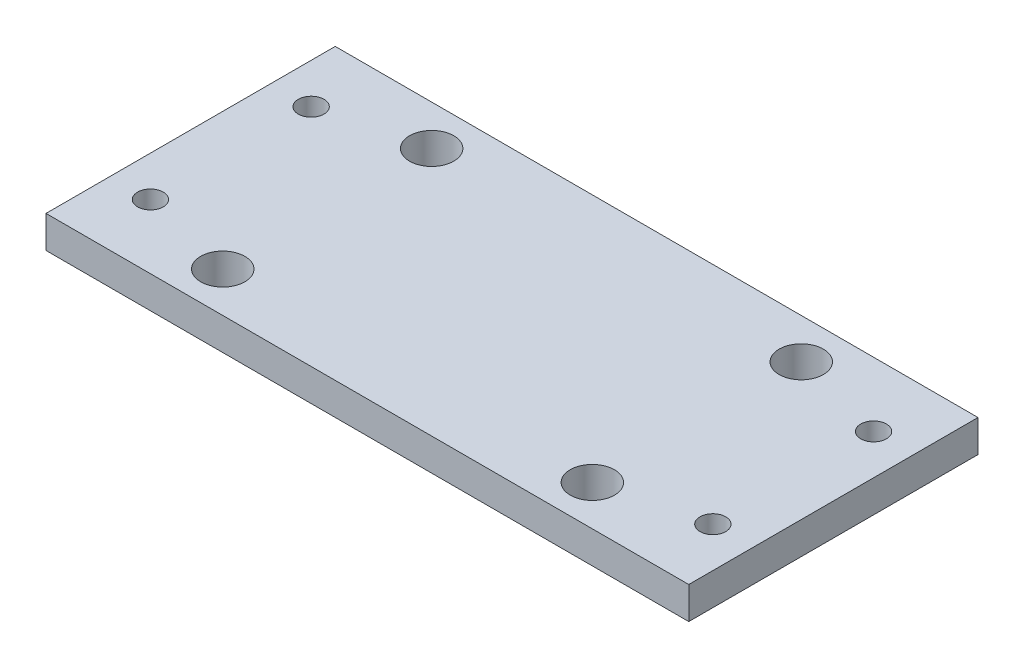
ISO-10303-21;
HEADER;
FILE_DESCRIPTION(('STEP AP214'),'2;1');
FILE_NAME('part.step','',(''),(''),'','','');
FILE_SCHEMA(('AUTOMOTIVE_DESIGN { 1 0 10303 214 1 1 1 1 }'));
ENDSEC;
DATA;
#1=APPLICATION_CONTEXT('core data for automotive mechanical design processes');
#2=APPLICATION_PROTOCOL_DEFINITION('international standard','automotive_design',2000,#1);
#3=PRODUCT_CONTEXT('',#1,'mechanical');
#4=PRODUCT('Part','Part','',(#3));
#5=PRODUCT_RELATED_PRODUCT_CATEGORY('part','',(#4));
#6=PRODUCT_DEFINITION_FORMATION('','',#4);
#7=PRODUCT_DEFINITION_CONTEXT('part definition',#1,'design');
#8=PRODUCT_DEFINITION('design','',#6,#7);
#9=PRODUCT_DEFINITION_SHAPE('','',#8);
#10=(LENGTH_UNIT() NAMED_UNIT(*) SI_UNIT(.MILLI.,.METRE.));
#11=(NAMED_UNIT(*) PLANE_ANGLE_UNIT() SI_UNIT($,.RADIAN.));
#12=(NAMED_UNIT(*) SI_UNIT($,.STERADIAN.) SOLID_ANGLE_UNIT());
#13=UNCERTAINTY_MEASURE_WITH_UNIT(LENGTH_MEASURE(1.E-05),#10,'distance_accuracy_value','');
#14=(GEOMETRIC_REPRESENTATION_CONTEXT(3) GLOBAL_UNCERTAINTY_ASSIGNED_CONTEXT((#13)) GLOBAL_UNIT_ASSIGNED_CONTEXT((#10,
#11,#12)) REPRESENTATION_CONTEXT('',''));
#15=CARTESIAN_POINT('',(0.,0.,0.));
#16=DIRECTION('',(0.,0.,1.));
#17=DIRECTION('',(1.,0.,0.));
#18=AXIS2_PLACEMENT_3D('',#15,#16,#17);
#19=CARTESIAN_POINT('',(0.,4.,0.));
#20=DIRECTION('',(0.,1.,0.));
#21=DIRECTION('',(0.,0.,1.));
#22=AXIS2_PLACEMENT_3D('',#19,#20,#21);
#23=PLANE('',#22);
#24=CARTESIAN_POINT('',(-41.9190774454018,4.,-4.48115885886842));
#25=DIRECTION('',(0.,1.,0.));
#26=DIRECTION('',(0.,0.,-1.));
#27=AXIS2_PLACEMENT_3D('',#24,#25,#26);
#28=CIRCLE('',#27,1.6);
#29=CARTESIAN_POINT('',(-41.9190774454018,4.,-6.08115885886841));
#30=VERTEX_POINT('',#29);
#31=EDGE_CURVE('E179',#30,#30,#28,.T.);
#32=ORIENTED_EDGE('',*,*,#31,.F.);
#33=EDGE_LOOP('',(#32));
#34=FACE_BOUND('',#33,.T.);
#35=CARTESIAN_POINT('',(-41.9190774454018,4.,-24.4811588588684));
#36=DIRECTION('',(0.,1.,0.));
#37=DIRECTION('',(0.,0.,1.));
#38=AXIS2_PLACEMENT_3D('',#35,#36,#37);
#39=CIRCLE('',#38,1.6);
#40=CARTESIAN_POINT('',(-41.9190774454018,4.,-22.8811588588684));
#41=VERTEX_POINT('',#40);
#42=EDGE_CURVE('E191',#41,#41,#39,.T.);
#43=ORIENTED_EDGE('',*,*,#42,.F.);
#44=EDGE_LOOP('',(#43));
#45=FACE_BOUND('',#44,.T.);
#46=CARTESIAN_POINT('',(-29.9190774454018,4.,-1.48115885886842));
#47=DIRECTION('',(0.,1.,0.));
#48=DIRECTION('',(0.,0.,1.));
#49=AXIS2_PLACEMENT_3D('',#46,#47,#48);
#50=CIRCLE('',#49,2.75);
#51=CARTESIAN_POINT('',(-29.9190774454018,4.,1.26884114113158));
#52=VERTEX_POINT('',#51);
#53=EDGE_CURVE('E203',#52,#52,#50,.T.);
#54=ORIENTED_EDGE('',*,*,#53,.F.);
#55=EDGE_LOOP('',(#54));
#56=FACE_BOUND('',#55,.T.);
#57=CARTESIAN_POINT('',(-29.9190774454018,4.,-27.4811588588684));
#58=DIRECTION('',(0.,1.,0.));
#59=DIRECTION('',(0.,0.,1.));
#60=AXIS2_PLACEMENT_3D('',#57,#58,#59);
#61=CIRCLE('',#60,2.75);
#62=CARTESIAN_POINT('',(-29.9190774454018,4.,-24.7311588588684));
#63=VERTEX_POINT('',#62);
#64=EDGE_CURVE('E106',#63,#63,#61,.T.);
#65=ORIENTED_EDGE('',*,*,#64,.F.);
#66=EDGE_LOOP('',(#65));
#67=FACE_BOUND('',#66,.T.);
#68=DIRECTION('',(-1.,0.,0.));
#69=VECTOR('',#68,1.);
#70=CARTESIAN_POINT('',(-34.9190774454018,4.,-32.4811588588684));
#71=LINE('',#70,#69);
#72=CARTESIAN_POINT('',(33.0809225545982,4.,-32.4811588588684));
#73=VERTEX_POINT('',#72);
#74=CARTESIAN_POINT('',(-46.9190774454018,4.,-32.4811588588684));
#75=VERTEX_POINT('',#74);
#76=EDGE_CURVE('E57',#73,#75,#71,.T.);
#77=ORIENTED_EDGE('',*,*,#76,.T.);
#78=DIRECTION('',(0.,0.,1.));
#79=VECTOR('',#78,1.);
#80=CARTESIAN_POINT('',(-46.9190774454018,4.,-32.4811588588684));
#81=LINE('',#80,#79);
#82=CARTESIAN_POINT('',(-46.9190774454018,4.,3.51884114113159));
#83=VERTEX_POINT('',#82);
#84=EDGE_CURVE('E87',#75,#83,#81,.T.);
#85=ORIENTED_EDGE('',*,*,#84,.T.);
#86=DIRECTION('',(1.,0.,0.));
#87=VECTOR('',#86,1.);
#88=CARTESIAN_POINT('',(-46.9190774454018,4.,3.51884114113159));
#89=LINE('',#88,#87);
#90=CARTESIAN_POINT('',(33.0809225545982,4.,3.51884114113159));
#91=VERTEX_POINT('',#90);
#92=EDGE_CURVE('E91',#83,#91,#89,.T.);
#93=ORIENTED_EDGE('',*,*,#92,.T.);
#94=DIRECTION('',(0.,0.,-1.));
#95=VECTOR('',#94,1.);
#96=CARTESIAN_POINT('',(33.0809225545982,4.,-32.4811588588684));
#97=LINE('',#96,#95);
#98=EDGE_CURVE('E99',#91,#73,#97,.T.);
#99=ORIENTED_EDGE('',*,*,#98,.T.);
#100=EDGE_LOOP('',(#77,#85,#93,#99));
#101=FACE_BOUND('',#100,.T.);
#102=CARTESIAN_POINT('',(16.0809225545982,4.,-27.4811588588684));
#103=DIRECTION('',(0.,1.,0.));
#104=DIRECTION('',(0.,0.,1.));
#105=AXIS2_PLACEMENT_3D('',#102,#103,#104);
#106=CIRCLE('',#105,2.75);
#107=CARTESIAN_POINT('',(16.0809225545982,4.,-24.7311588588684));
#108=VERTEX_POINT('',#107);
#109=EDGE_CURVE('E209',#108,#108,#106,.T.);
#110=ORIENTED_EDGE('',*,*,#109,.F.);
#111=EDGE_LOOP('',(#110));
#112=FACE_BOUND('',#111,.T.);
#113=CARTESIAN_POINT('',(16.0809225545982,4.,-1.48115885886842));
#114=DIRECTION('',(0.,1.,0.));
#115=DIRECTION('',(0.,0.,1.));
#116=AXIS2_PLACEMENT_3D('',#113,#114,#115);
#117=CIRCLE('',#116,2.75);
#118=CARTESIAN_POINT('',(16.0809225545982,4.,1.26884114113157));
#119=VERTEX_POINT('',#118);
#120=EDGE_CURVE('E197',#119,#119,#117,.T.);
#121=ORIENTED_EDGE('',*,*,#120,.F.);
#122=EDGE_LOOP('',(#121));
#123=FACE_BOUND('',#122,.T.);
#124=CARTESIAN_POINT('',(28.0809225545982,4.,-24.4811588588684));
#125=DIRECTION('',(0.,1.,0.));
#126=DIRECTION('',(0.,0.,-1.));
#127=AXIS2_PLACEMENT_3D('',#124,#125,#126);
#128=CIRCLE('',#127,1.6);
#129=CARTESIAN_POINT('',(28.0809225545982,4.,-26.0811588588684));
#130=VERTEX_POINT('',#129);
#131=EDGE_CURVE('E185',#130,#130,#128,.T.);
#132=ORIENTED_EDGE('',*,*,#131,.F.);
#133=EDGE_LOOP('',(#132));
#134=FACE_BOUND('',#133,.T.);
#135=CARTESIAN_POINT('',(28.0809225545982,4.,-4.48115885886842));
#136=DIRECTION('',(0.,1.,0.));
#137=DIRECTION('',(0.,0.,1.));
#138=AXIS2_PLACEMENT_3D('',#135,#136,#137);
#139=CIRCLE('',#138,1.6);
#140=CARTESIAN_POINT('',(28.0809225545982,4.,-2.88115885886842));
#141=VERTEX_POINT('',#140);
#142=EDGE_CURVE('E170',#141,#141,#139,.T.);
#143=ORIENTED_EDGE('',*,*,#142,.F.);
#144=EDGE_LOOP('',(#143));
#145=FACE_BOUND('',#144,.T.);
#146=ADVANCED_FACE('F40',(#34,#45,#56,#67,#101,#112,#123,#134,#145),#23,.T.);
#147=CARTESIAN_POINT('',(0.,0.,0.));
#148=DIRECTION('',(0.,1.,0.));
#149=DIRECTION('',(0.,0.,1.));
#150=AXIS2_PLACEMENT_3D('',#147,#148,#149);
#151=PLANE('',#150);
#152=DIRECTION('',(0.,0.,1.));
#153=VECTOR('',#152,1.);
#154=CARTESIAN_POINT('',(-46.9190774454018,0.,-32.4811588588684));
#155=LINE('',#154,#153);
#156=CARTESIAN_POINT('',(-46.9190774454018,0.,-32.4811588588684));
#157=VERTEX_POINT('',#156);
#158=CARTESIAN_POINT('',(-46.9190774454018,0.,3.51884114113159));
#159=VERTEX_POINT('',#158);
#160=EDGE_CURVE('E95',#157,#159,#155,.T.);
#161=ORIENTED_EDGE('',*,*,#160,.F.);
#162=DIRECTION('',(-1.,0.,0.));
#163=VECTOR('',#162,1.);
#164=CARTESIAN_POINT('',(-34.9190774454018,0.,-32.4811588588684));
#165=LINE('',#164,#163);
#166=CARTESIAN_POINT('',(33.0809225545982,0.,-32.4811588588684));
#167=VERTEX_POINT('',#166);
#168=EDGE_CURVE('E109',#167,#157,#165,.T.);
#169=ORIENTED_EDGE('',*,*,#168,.F.);
#170=DIRECTION('',(0.,0.,-1.));
#171=VECTOR('',#170,1.);
#172=CARTESIAN_POINT('',(33.0809225545982,0.,-32.4811588588684));
#173=LINE('',#172,#171);
#174=CARTESIAN_POINT('',(33.0809225545982,0.,3.51884114113159));
#175=VERTEX_POINT('',#174);
#176=EDGE_CURVE('E81',#175,#167,#173,.T.);
#177=ORIENTED_EDGE('',*,*,#176,.F.);
#178=DIRECTION('',(1.,0.,0.));
#179=VECTOR('',#178,1.);
#180=CARTESIAN_POINT('',(-34.9190774454018,0.,3.51884114113159));
#181=LINE('',#180,#179);
#182=EDGE_CURVE('E74',#159,#175,#181,.T.);
#183=ORIENTED_EDGE('',*,*,#182,.F.);
#184=EDGE_LOOP('',(#161,#169,#177,#183));
#185=FACE_BOUND('',#184,.T.);
#186=CARTESIAN_POINT('',(-29.9190774454018,0.,-27.4811588588684));
#187=DIRECTION('',(0.,1.,0.));
#188=DIRECTION('',(0.,0.,1.));
#189=AXIS2_PLACEMENT_3D('',#186,#187,#188);
#190=CIRCLE('',#189,2.75);
#191=CARTESIAN_POINT('',(-29.9190774454018,0.,-24.7311588588684));
#192=VERTEX_POINT('',#191);
#193=EDGE_CURVE('E212',#192,#192,#190,.T.);
#194=ORIENTED_EDGE('',*,*,#193,.T.);
#195=EDGE_LOOP('',(#194));
#196=FACE_BOUND('',#195,.T.);
#197=CARTESIAN_POINT('',(16.0809225545982,0.,-27.4811588588684));
#198=DIRECTION('',(0.,1.,0.));
#199=DIRECTION('',(0.,0.,1.));
#200=AXIS2_PLACEMENT_3D('',#197,#198,#199);
#201=CIRCLE('',#200,2.75);
#202=CARTESIAN_POINT('',(16.0809225545982,0.,-24.7311588588684));
#203=VERTEX_POINT('',#202);
#204=EDGE_CURVE('E206',#203,#203,#201,.T.);
#205=ORIENTED_EDGE('',*,*,#204,.T.);
#206=EDGE_LOOP('',(#205));
#207=FACE_BOUND('',#206,.T.);
#208=CARTESIAN_POINT('',(-29.9190774454018,0.,-1.48115885886842));
#209=DIRECTION('',(0.,1.,0.));
#210=DIRECTION('',(0.,0.,1.));
#211=AXIS2_PLACEMENT_3D('',#208,#209,#210);
#212=CIRCLE('',#211,2.75);
#213=CARTESIAN_POINT('',(-29.9190774454018,0.,1.26884114113158));
#214=VERTEX_POINT('',#213);
#215=EDGE_CURVE('E200',#214,#214,#212,.T.);
#216=ORIENTED_EDGE('',*,*,#215,.T.);
#217=EDGE_LOOP('',(#216));
#218=FACE_BOUND('',#217,.T.);
#219=CARTESIAN_POINT('',(16.0809225545982,0.,-1.48115885886842));
#220=DIRECTION('',(0.,1.,0.));
#221=DIRECTION('',(0.,0.,1.));
#222=AXIS2_PLACEMENT_3D('',#219,#220,#221);
#223=CIRCLE('',#222,2.75);
#224=CARTESIAN_POINT('',(16.0809225545982,0.,1.26884114113157));
#225=VERTEX_POINT('',#224);
#226=EDGE_CURVE('E194',#225,#225,#223,.T.);
#227=ORIENTED_EDGE('',*,*,#226,.T.);
#228=EDGE_LOOP('',(#227));
#229=FACE_BOUND('',#228,.T.);
#230=CARTESIAN_POINT('',(-41.9190774454018,0.,-24.4811588588684));
#231=DIRECTION('',(0.,1.,0.));
#232=DIRECTION('',(0.,0.,1.));
#233=AXIS2_PLACEMENT_3D('',#230,#231,#232);
#234=CIRCLE('',#233,1.6);
#235=CARTESIAN_POINT('',(-41.9190774454018,0.,-22.8811588588684));
#236=VERTEX_POINT('',#235);
#237=EDGE_CURVE('E188',#236,#236,#234,.T.);
#238=ORIENTED_EDGE('',*,*,#237,.T.);
#239=EDGE_LOOP('',(#238));
#240=FACE_BOUND('',#239,.T.);
#241=CARTESIAN_POINT('',(28.0809225545982,0.,-24.4811588588684));
#242=DIRECTION('',(0.,1.,0.));
#243=DIRECTION('',(0.,0.,-1.));
#244=AXIS2_PLACEMENT_3D('',#241,#242,#243);
#245=CIRCLE('',#244,1.6);
#246=CARTESIAN_POINT('',(28.0809225545982,0.,-26.0811588588684));
#247=VERTEX_POINT('',#246);
#248=EDGE_CURVE('E182',#247,#247,#245,.T.);
#249=ORIENTED_EDGE('',*,*,#248,.T.);
#250=EDGE_LOOP('',(#249));
#251=FACE_BOUND('',#250,.T.);
#252=CARTESIAN_POINT('',(-41.9190774454018,0.,-4.48115885886842));
#253=DIRECTION('',(0.,1.,0.));
#254=DIRECTION('',(0.,0.,-1.));
#255=AXIS2_PLACEMENT_3D('',#252,#253,#254);
#256=CIRCLE('',#255,1.6);
#257=CARTESIAN_POINT('',(-41.9190774454018,0.,-6.08115885886841));
#258=VERTEX_POINT('',#257);
#259=EDGE_CURVE('E176',#258,#258,#256,.T.);
#260=ORIENTED_EDGE('',*,*,#259,.T.);
#261=EDGE_LOOP('',(#260));
#262=FACE_BOUND('',#261,.T.);
#263=CARTESIAN_POINT('',(28.0809225545982,0.,-4.48115885886842));
#264=DIRECTION('',(0.,1.,0.));
#265=DIRECTION('',(0.,0.,1.));
#266=AXIS2_PLACEMENT_3D('',#263,#264,#265);
#267=CIRCLE('',#266,1.6);
#268=CARTESIAN_POINT('',(28.0809225545982,0.,-2.88115885886842));
#269=VERTEX_POINT('',#268);
#270=EDGE_CURVE('E173',#269,#269,#267,.T.);
#271=ORIENTED_EDGE('',*,*,#270,.T.);
#272=EDGE_LOOP('',(#271));
#273=FACE_BOUND('',#272,.T.);
#274=ADVANCED_FACE('F115',(#185,#196,#207,#218,#229,#240,#251,#262,#273),#151,.F.);
#275=CARTESIAN_POINT('',(-46.9190774454018,4.,-32.4811588588684));
#276=DIRECTION('',(1.,0.,0.));
#277=DIRECTION('',(0.,0.,-1.));
#278=AXIS2_PLACEMENT_3D('',#275,#276,#277);
#279=PLANE('',#278);
#280=ORIENTED_EDGE('',*,*,#160,.T.);
#281=DIRECTION('',(0.,-1.,0.));
#282=VECTOR('',#281,1.);
#283=CARTESIAN_POINT('',(-46.9190774454018,4.,3.51884114113159));
#284=LINE('',#283,#282);
#285=EDGE_CURVE('E49',#83,#159,#284,.T.);
#286=ORIENTED_EDGE('',*,*,#285,.F.);
#287=ORIENTED_EDGE('',*,*,#84,.F.);
#288=DIRECTION('',(0.,-1.,0.));
#289=VECTOR('',#288,1.);
#290=CARTESIAN_POINT('',(-46.9190774454018,4.,-32.4811588588684));
#291=LINE('',#290,#289);
#292=EDGE_CURVE('E11',#75,#157,#291,.T.);
#293=ORIENTED_EDGE('',*,*,#292,.T.);
#294=EDGE_LOOP('',(#280,#286,#287,#293));
#295=FACE_BOUND('',#294,.T.);
#296=ADVANCED_FACE('F42',(#295),#279,.F.);
#297=CARTESIAN_POINT('',(-34.9190774454018,4.,3.51884114113159));
#298=DIRECTION('',(0.,0.,-1.));
#299=DIRECTION('',(-1.,0.,0.));
#300=AXIS2_PLACEMENT_3D('',#297,#298,#299);
#301=PLANE('',#300);
#302=ORIENTED_EDGE('',*,*,#182,.T.);
#303=DIRECTION('',(0.,-1.,0.));
#304=VECTOR('',#303,1.);
#305=CARTESIAN_POINT('',(33.0809225545982,4.,3.51884114113159));
#306=LINE('',#305,#304);
#307=EDGE_CURVE('E96',#91,#175,#306,.T.);
#308=ORIENTED_EDGE('',*,*,#307,.F.);
#309=ORIENTED_EDGE('',*,*,#92,.F.);
#310=ORIENTED_EDGE('',*,*,#285,.T.);
#311=EDGE_LOOP('',(#302,#308,#309,#310));
#312=FACE_BOUND('',#311,.T.);
#313=ADVANCED_FACE('F97',(#312),#301,.F.);
#314=CARTESIAN_POINT('',(33.0809225545982,4.,-32.4811588588684));
#315=DIRECTION('',(-1.,0.,0.));
#316=DIRECTION('',(0.,0.,1.));
#317=AXIS2_PLACEMENT_3D('',#314,#315,#316);
#318=PLANE('',#317);
#319=ORIENTED_EDGE('',*,*,#176,.T.);
#320=DIRECTION('',(0.,-1.,0.));
#321=VECTOR('',#320,1.);
#322=CARTESIAN_POINT('',(33.0809225545982,4.,-32.4811588588684));
#323=LINE('',#322,#321);
#324=EDGE_CURVE('E101',#73,#167,#323,.T.);
#325=ORIENTED_EDGE('',*,*,#324,.F.);
#326=ORIENTED_EDGE('',*,*,#98,.F.);
#327=ORIENTED_EDGE('',*,*,#307,.T.);
#328=EDGE_LOOP('',(#319,#325,#326,#327));
#329=FACE_BOUND('',#328,.T.);
#330=ADVANCED_FACE('F112',(#329),#318,.F.);
#331=CARTESIAN_POINT('',(-34.9190774454018,4.,-32.4811588588684));
#332=DIRECTION('',(0.,0.,1.));
#333=DIRECTION('',(1.,0.,0.));
#334=AXIS2_PLACEMENT_3D('',#331,#332,#333);
#335=PLANE('',#334);
#336=ORIENTED_EDGE('',*,*,#168,.T.);
#337=ORIENTED_EDGE('',*,*,#292,.F.);
#338=ORIENTED_EDGE('',*,*,#76,.F.);
#339=ORIENTED_EDGE('',*,*,#324,.T.);
#340=EDGE_LOOP('',(#336,#337,#338,#339));
#341=FACE_BOUND('',#340,.T.);
#342=ADVANCED_FACE('F117',(#341),#335,.F.);
#343=CARTESIAN_POINT('',(-29.9190774454018,4.,-27.4811588588684));
#344=DIRECTION('',(0.,-1.,0.));
#345=DIRECTION('',(0.,0.,-1.));
#346=AXIS2_PLACEMENT_3D('',#343,#344,#345);
#347=CYLINDRICAL_SURFACE('',#346,2.75);
#348=ORIENTED_EDGE('',*,*,#64,.T.);
#349=EDGE_LOOP('',(#348));
#350=FACE_BOUND('',#349,.T.);
#351=ORIENTED_EDGE('',*,*,#193,.F.);
#352=EDGE_LOOP('',(#351));
#353=FACE_BOUND('',#352,.T.);
#354=ADVANCED_FACE('F119',(#350,#353),#347,.F.);
#355=CARTESIAN_POINT('',(16.0809225545982,4.,-27.4811588588684));
#356=DIRECTION('',(0.,-1.,0.));
#357=DIRECTION('',(0.,0.,-1.));
#358=AXIS2_PLACEMENT_3D('',#355,#356,#357);
#359=CYLINDRICAL_SURFACE('',#358,2.75);
#360=ORIENTED_EDGE('',*,*,#109,.T.);
#361=EDGE_LOOP('',(#360));
#362=FACE_BOUND('',#361,.T.);
#363=ORIENTED_EDGE('',*,*,#204,.F.);
#364=EDGE_LOOP('',(#363));
#365=FACE_BOUND('',#364,.T.);
#366=ADVANCED_FACE('F125',(#362,#365),#359,.F.);
#367=CARTESIAN_POINT('',(-29.9190774454018,4.,-1.48115885886842));
#368=DIRECTION('',(0.,-1.,0.));
#369=DIRECTION('',(0.,0.,-1.));
#370=AXIS2_PLACEMENT_3D('',#367,#368,#369);
#371=CYLINDRICAL_SURFACE('',#370,2.75);
#372=ORIENTED_EDGE('',*,*,#53,.T.);
#373=EDGE_LOOP('',(#372));
#374=FACE_BOUND('',#373,.T.);
#375=ORIENTED_EDGE('',*,*,#215,.F.);
#376=EDGE_LOOP('',(#375));
#377=FACE_BOUND('',#376,.T.);
#378=ADVANCED_FACE('F141',(#374,#377),#371,.F.);
#379=CARTESIAN_POINT('',(16.0809225545982,4.,-1.48115885886842));
#380=DIRECTION('',(0.,-1.,0.));
#381=DIRECTION('',(0.,0.,-1.));
#382=AXIS2_PLACEMENT_3D('',#379,#380,#381);
#383=CYLINDRICAL_SURFACE('',#382,2.75);
#384=ORIENTED_EDGE('',*,*,#120,.T.);
#385=EDGE_LOOP('',(#384));
#386=FACE_BOUND('',#385,.T.);
#387=ORIENTED_EDGE('',*,*,#226,.F.);
#388=EDGE_LOOP('',(#387));
#389=FACE_BOUND('',#388,.T.);
#390=ADVANCED_FACE('F145',(#386,#389),#383,.F.);
#391=CARTESIAN_POINT('',(-41.9190774454018,4.,-24.4811588588684));
#392=DIRECTION('',(0.,-1.,0.));
#393=DIRECTION('',(0.,0.,-1.));
#394=AXIS2_PLACEMENT_3D('',#391,#392,#393);
#395=CYLINDRICAL_SURFACE('',#394,1.6);
#396=ORIENTED_EDGE('',*,*,#42,.T.);
#397=EDGE_LOOP('',(#396));
#398=FACE_BOUND('',#397,.T.);
#399=ORIENTED_EDGE('',*,*,#237,.F.);
#400=EDGE_LOOP('',(#399));
#401=FACE_BOUND('',#400,.T.);
#402=ADVANCED_FACE('F149',(#398,#401),#395,.F.);
#403=CARTESIAN_POINT('',(28.0809225545982,4.,-24.4811588588684));
#404=DIRECTION('',(0.,-1.,0.));
#405=DIRECTION('',(0.,0.,-1.));
#406=AXIS2_PLACEMENT_3D('',#403,#404,#405);
#407=CYLINDRICAL_SURFACE('',#406,1.6);
#408=ORIENTED_EDGE('',*,*,#131,.T.);
#409=EDGE_LOOP('',(#408));
#410=FACE_BOUND('',#409,.T.);
#411=ORIENTED_EDGE('',*,*,#248,.F.);
#412=EDGE_LOOP('',(#411));
#413=FACE_BOUND('',#412,.T.);
#414=ADVANCED_FACE('F153',(#410,#413),#407,.F.);
#415=CARTESIAN_POINT('',(-41.9190774454018,4.,-4.48115885886842));
#416=DIRECTION('',(0.,-1.,0.));
#417=DIRECTION('',(0.,0.,-1.));
#418=AXIS2_PLACEMENT_3D('',#415,#416,#417);
#419=CYLINDRICAL_SURFACE('',#418,1.6);
#420=ORIENTED_EDGE('',*,*,#31,.T.);
#421=EDGE_LOOP('',(#420));
#422=FACE_BOUND('',#421,.T.);
#423=ORIENTED_EDGE('',*,*,#259,.F.);
#424=EDGE_LOOP('',(#423));
#425=FACE_BOUND('',#424,.T.);
#426=ADVANCED_FACE('F157',(#422,#425),#419,.F.);
#427=CARTESIAN_POINT('',(28.0809225545982,4.,-4.48115885886842));
#428=DIRECTION('',(0.,-1.,0.));
#429=DIRECTION('',(0.,0.,-1.));
#430=AXIS2_PLACEMENT_3D('',#427,#428,#429);
#431=CYLINDRICAL_SURFACE('',#430,1.6);
#432=ORIENTED_EDGE('',*,*,#142,.T.);
#433=EDGE_LOOP('',(#432));
#434=FACE_BOUND('',#433,.T.);
#435=ORIENTED_EDGE('',*,*,#270,.F.);
#436=EDGE_LOOP('',(#435));
#437=FACE_BOUND('',#436,.T.);
#438=ADVANCED_FACE('F161',(#434,#437),#431,.F.);
#439=CLOSED_SHELL('',(#146,#274,#296,#313,#330,#342,#354,#366,#378,#390,#402,#414,#426,#438));
#440=MANIFOLD_SOLID_BREP('B2',#439);
#441=ADVANCED_BREP_SHAPE_REPRESENTATION('',(#18,#440),#14);
#442=SHAPE_DEFINITION_REPRESENTATION(#9,#441);
ENDSEC;
END-ISO-10303-21;
